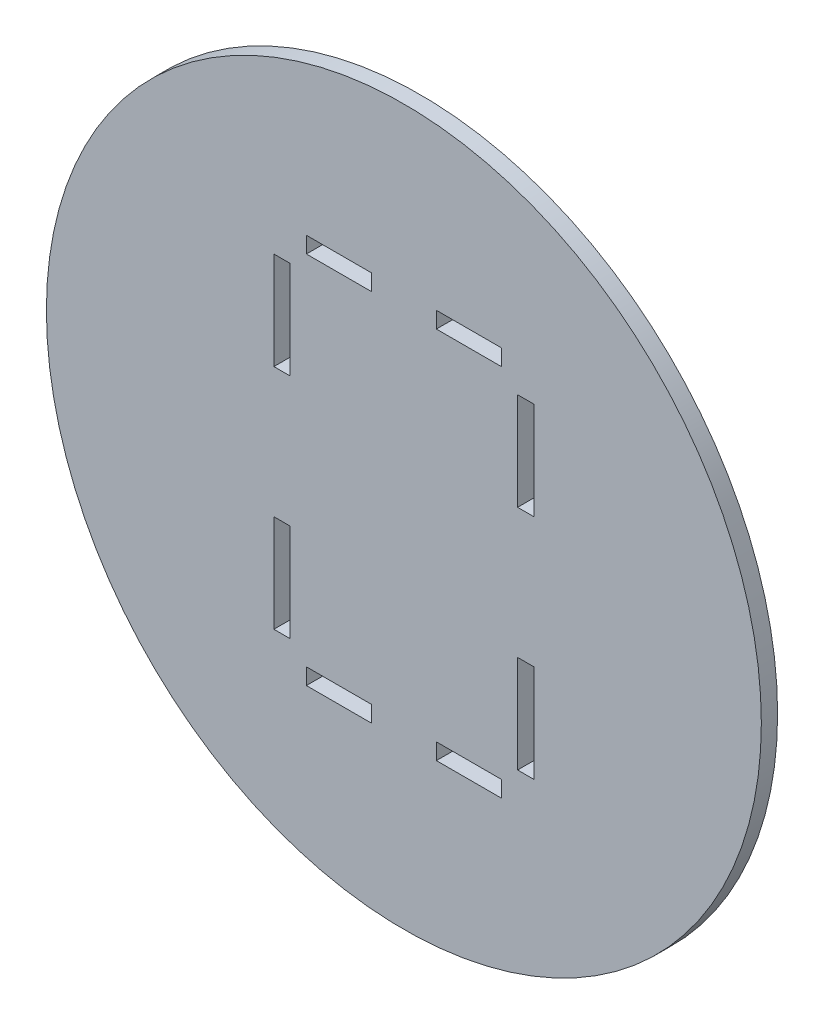
ISO-10303-21;
HEADER;
FILE_DESCRIPTION(('STEP AP214'),'2;1');
FILE_NAME('part.step','',(''),(''),'','','');
FILE_SCHEMA(('AUTOMOTIVE_DESIGN { 1 0 10303 214 1 1 1 1 }'));
ENDSEC;
DATA;
#1=APPLICATION_CONTEXT('core data for automotive mechanical design processes');
#2=APPLICATION_PROTOCOL_DEFINITION('international standard','automotive_design',2000,#1);
#3=PRODUCT_CONTEXT('',#1,'mechanical');
#4=PRODUCT('Part','Part','',(#3));
#5=PRODUCT_RELATED_PRODUCT_CATEGORY('part','',(#4));
#6=PRODUCT_DEFINITION_FORMATION('','',#4);
#7=PRODUCT_DEFINITION_CONTEXT('part definition',#1,'design');
#8=PRODUCT_DEFINITION('design','',#6,#7);
#9=PRODUCT_DEFINITION_SHAPE('','',#8);
#10=(LENGTH_UNIT() NAMED_UNIT(*) SI_UNIT(.MILLI.,.METRE.));
#11=(NAMED_UNIT(*) PLANE_ANGLE_UNIT() SI_UNIT($,.RADIAN.));
#12=(NAMED_UNIT(*) SI_UNIT($,.STERADIAN.) SOLID_ANGLE_UNIT());
#13=UNCERTAINTY_MEASURE_WITH_UNIT(LENGTH_MEASURE(1.E-05),#10,'distance_accuracy_value','');
#14=(GEOMETRIC_REPRESENTATION_CONTEXT(3) GLOBAL_UNCERTAINTY_ASSIGNED_CONTEXT((#13)) GLOBAL_UNIT_ASSIGNED_CONTEXT((#10,
#11,#12)) REPRESENTATION_CONTEXT('',''));
#15=CARTESIAN_POINT('',(0.,0.,0.));
#16=DIRECTION('',(0.,0.,1.));
#17=DIRECTION('',(1.,0.,0.));
#18=AXIS2_PLACEMENT_3D('',#15,#16,#17);
#19=CARTESIAN_POINT('',(0.,0.,5.));
#20=DIRECTION('',(0.,0.,1.));
#21=DIRECTION('',(1.,0.,0.));
#22=AXIS2_PLACEMENT_3D('',#19,#20,#21);
#23=PLANE('',#22);
#24=CARTESIAN_POINT('',(0.,0.,5.));
#25=DIRECTION('',(0.,0.,1.));
#26=DIRECTION('',(1.,0.,0.));
#27=AXIS2_PLACEMENT_3D('',#24,#25,#26);
#28=CIRCLE('',#27,110.);
#29=CARTESIAN_POINT('',(110.,0.,5.));
#30=VERTEX_POINT('',#29);
#31=EDGE_CURVE('E11',#30,#30,#28,.T.);
#32=ORIENTED_EDGE('',*,*,#31,.T.);
#33=EDGE_LOOP('',(#32));
#34=FACE_BOUND('',#33,.T.);
#35=DIRECTION('',(1.,0.,0.));
#36=VECTOR('',#35,1.);
#37=CARTESIAN_POINT('',(-30.,55.,5.));
#38=LINE('',#37,#36);
#39=CARTESIAN_POINT('',(-30.,55.,5.));
#40=VERTEX_POINT('',#39);
#41=CARTESIAN_POINT('',(-10.,55.,5.));
#42=VERTEX_POINT('',#41);
#43=EDGE_CURVE('E466',#40,#42,#38,.T.);
#44=ORIENTED_EDGE('',*,*,#43,.F.);
#45=DIRECTION('',(0.,-1.,0.));
#46=VECTOR('',#45,1.);
#47=CARTESIAN_POINT('',(-30.,60.,5.));
#48=LINE('',#47,#46);
#49=CARTESIAN_POINT('',(-30.,60.,5.));
#50=VERTEX_POINT('',#49);
#51=EDGE_CURVE('E464',#50,#40,#48,.T.);
#52=ORIENTED_EDGE('',*,*,#51,.F.);
#53=DIRECTION('',(-1.,0.,0.));
#54=VECTOR('',#53,1.);
#55=CARTESIAN_POINT('',(-30.,60.,5.));
#56=LINE('',#55,#54);
#57=CARTESIAN_POINT('',(-10.,60.,5.));
#58=VERTEX_POINT('',#57);
#59=EDGE_CURVE('E472',#58,#50,#56,.T.);
#60=ORIENTED_EDGE('',*,*,#59,.F.);
#61=DIRECTION('',(0.,1.,0.));
#62=VECTOR('',#61,1.);
#63=CARTESIAN_POINT('',(-10.,60.,5.));
#64=LINE('',#63,#62);
#65=EDGE_CURVE('E469',#42,#58,#64,.T.);
#66=ORIENTED_EDGE('',*,*,#65,.F.);
#67=EDGE_LOOP('',(#44,#52,#60,#66));
#68=FACE_BOUND('',#67,.T.);
#69=DIRECTION('',(1.,0.,0.));
#70=VECTOR('',#69,1.);
#71=CARTESIAN_POINT('',(10.,55.,5.));
#72=LINE('',#71,#70);
#73=CARTESIAN_POINT('',(10.,55.,5.));
#74=VERTEX_POINT('',#73);
#75=CARTESIAN_POINT('',(30.,55.,5.));
#76=VERTEX_POINT('',#75);
#77=EDGE_CURVE('E435',#74,#76,#72,.T.);
#78=ORIENTED_EDGE('',*,*,#77,.F.);
#79=DIRECTION('',(0.,-1.,0.));
#80=VECTOR('',#79,1.);
#81=CARTESIAN_POINT('',(10.,60.,5.));
#82=LINE('',#81,#80);
#83=CARTESIAN_POINT('',(10.,60.,5.));
#84=VERTEX_POINT('',#83);
#85=EDGE_CURVE('E433',#84,#74,#82,.T.);
#86=ORIENTED_EDGE('',*,*,#85,.F.);
#87=DIRECTION('',(-1.,0.,0.));
#88=VECTOR('',#87,1.);
#89=CARTESIAN_POINT('',(10.,60.,5.));
#90=LINE('',#89,#88);
#91=CARTESIAN_POINT('',(30.,60.,5.));
#92=VERTEX_POINT('',#91);
#93=EDGE_CURVE('E441',#92,#84,#90,.T.);
#94=ORIENTED_EDGE('',*,*,#93,.F.);
#95=DIRECTION('',(0.,1.,0.));
#96=VECTOR('',#95,1.);
#97=CARTESIAN_POINT('',(30.,60.,5.));
#98=LINE('',#97,#96);
#99=EDGE_CURVE('E438',#76,#92,#98,.T.);
#100=ORIENTED_EDGE('',*,*,#99,.F.);
#101=EDGE_LOOP('',(#78,#86,#94,#100));
#102=FACE_BOUND('',#101,.T.);
#103=DIRECTION('',(-1.,0.,0.));
#104=VECTOR('',#103,1.);
#105=CARTESIAN_POINT('',(40.,50.,5.));
#106=LINE('',#105,#104);
#107=CARTESIAN_POINT('',(40.,50.,5.));
#108=VERTEX_POINT('',#107);
#109=CARTESIAN_POINT('',(35.,50.,5.));
#110=VERTEX_POINT('',#109);
#111=EDGE_CURVE('E404',#108,#110,#106,.T.);
#112=ORIENTED_EDGE('',*,*,#111,.F.);
#113=DIRECTION('',(0.,1.,0.));
#114=VECTOR('',#113,1.);
#115=CARTESIAN_POINT('',(40.,50.,5.));
#116=LINE('',#115,#114);
#117=CARTESIAN_POINT('',(40.,20.,5.));
#118=VERTEX_POINT('',#117);
#119=EDGE_CURVE('E402',#118,#108,#116,.T.);
#120=ORIENTED_EDGE('',*,*,#119,.F.);
#121=DIRECTION('',(1.,0.,0.));
#122=VECTOR('',#121,1.);
#123=CARTESIAN_POINT('',(40.,20.,5.));
#124=LINE('',#123,#122);
#125=CARTESIAN_POINT('',(35.,20.,5.));
#126=VERTEX_POINT('',#125);
#127=EDGE_CURVE('E410',#126,#118,#124,.T.);
#128=ORIENTED_EDGE('',*,*,#127,.F.);
#129=DIRECTION('',(0.,-1.,0.));
#130=VECTOR('',#129,1.);
#131=CARTESIAN_POINT('',(35.,50.,5.));
#132=LINE('',#131,#130);
#133=EDGE_CURVE('E407',#110,#126,#132,.T.);
#134=ORIENTED_EDGE('',*,*,#133,.F.);
#135=EDGE_LOOP('',(#112,#120,#128,#134));
#136=FACE_BOUND('',#135,.T.);
#137=DIRECTION('',(-1.,0.,0.));
#138=VECTOR('',#137,1.);
#139=CARTESIAN_POINT('',(40.,-20.,5.));
#140=LINE('',#139,#138);
#141=CARTESIAN_POINT('',(40.,-20.,5.));
#142=VERTEX_POINT('',#141);
#143=CARTESIAN_POINT('',(35.,-20.,5.));
#144=VERTEX_POINT('',#143);
#145=EDGE_CURVE('E373',#142,#144,#140,.T.);
#146=ORIENTED_EDGE('',*,*,#145,.F.);
#147=DIRECTION('',(0.,1.,0.));
#148=VECTOR('',#147,1.);
#149=CARTESIAN_POINT('',(40.,-20.,5.));
#150=LINE('',#149,#148);
#151=CARTESIAN_POINT('',(40.0000000000001,-50.,5.));
#152=VERTEX_POINT('',#151);
#153=EDGE_CURVE('E371',#152,#142,#150,.T.);
#154=ORIENTED_EDGE('',*,*,#153,.F.);
#155=DIRECTION('',(1.,0.,0.));
#156=VECTOR('',#155,1.);
#157=CARTESIAN_POINT('',(40.0000000000001,-50.,5.));
#158=LINE('',#157,#156);
#159=CARTESIAN_POINT('',(35.,-50.,5.));
#160=VERTEX_POINT('',#159);
#161=EDGE_CURVE('E379',#160,#152,#158,.T.);
#162=ORIENTED_EDGE('',*,*,#161,.F.);
#163=DIRECTION('',(0.,-1.,0.));
#164=VECTOR('',#163,1.);
#165=CARTESIAN_POINT('',(35.,-20.,5.));
#166=LINE('',#165,#164);
#167=EDGE_CURVE('E376',#144,#160,#166,.T.);
#168=ORIENTED_EDGE('',*,*,#167,.F.);
#169=EDGE_LOOP('',(#146,#154,#162,#168));
#170=FACE_BOUND('',#169,.T.);
#171=DIRECTION('',(-1.,0.,0.));
#172=VECTOR('',#171,1.);
#173=CARTESIAN_POINT('',(30.0000000000001,-55.,5.));
#174=LINE('',#173,#172);
#175=CARTESIAN_POINT('',(30.0000000000001,-55.,5.));
#176=VERTEX_POINT('',#175);
#177=CARTESIAN_POINT('',(10.0000000000001,-55.,5.));
#178=VERTEX_POINT('',#177);
#179=EDGE_CURVE('E342',#176,#178,#174,.T.);
#180=ORIENTED_EDGE('',*,*,#179,.F.);
#181=DIRECTION('',(0.,1.,0.));
#182=VECTOR('',#181,1.);
#183=CARTESIAN_POINT('',(30.0000000000001,-60.,5.));
#184=LINE('',#183,#182);
#185=CARTESIAN_POINT('',(30.0000000000001,-60.,5.));
#186=VERTEX_POINT('',#185);
#187=EDGE_CURVE('E340',#186,#176,#184,.T.);
#188=ORIENTED_EDGE('',*,*,#187,.F.);
#189=DIRECTION('',(1.,0.,0.));
#190=VECTOR('',#189,1.);
#191=CARTESIAN_POINT('',(30.0000000000001,-60.,5.));
#192=LINE('',#191,#190);
#193=CARTESIAN_POINT('',(10.0000000000001,-60.,5.));
#194=VERTEX_POINT('',#193);
#195=EDGE_CURVE('E348',#194,#186,#192,.T.);
#196=ORIENTED_EDGE('',*,*,#195,.F.);
#197=DIRECTION('',(0.,-1.,0.));
#198=VECTOR('',#197,1.);
#199=CARTESIAN_POINT('',(10.0000000000001,-60.,5.));
#200=LINE('',#199,#198);
#201=EDGE_CURVE('E345',#178,#194,#200,.T.);
#202=ORIENTED_EDGE('',*,*,#201,.F.);
#203=EDGE_LOOP('',(#180,#188,#196,#202));
#204=FACE_BOUND('',#203,.T.);
#205=DIRECTION('',(-1.,0.,0.));
#206=VECTOR('',#205,1.);
#207=CARTESIAN_POINT('',(-9.99999999999993,-55.,5.));
#208=LINE('',#207,#206);
#209=CARTESIAN_POINT('',(-9.99999999999993,-55.,5.));
#210=VERTEX_POINT('',#209);
#211=CARTESIAN_POINT('',(-29.9999999999999,-55.,5.));
#212=VERTEX_POINT('',#211);
#213=EDGE_CURVE('E311',#210,#212,#208,.T.);
#214=ORIENTED_EDGE('',*,*,#213,.F.);
#215=DIRECTION('',(0.,1.,0.));
#216=VECTOR('',#215,1.);
#217=CARTESIAN_POINT('',(-9.99999999999993,-60.,5.));
#218=LINE('',#217,#216);
#219=CARTESIAN_POINT('',(-9.99999999999993,-60.,5.));
#220=VERTEX_POINT('',#219);
#221=EDGE_CURVE('E309',#220,#210,#218,.T.);
#222=ORIENTED_EDGE('',*,*,#221,.F.);
#223=DIRECTION('',(1.,0.,0.));
#224=VECTOR('',#223,1.);
#225=CARTESIAN_POINT('',(-9.99999999999993,-60.,5.));
#226=LINE('',#225,#224);
#227=CARTESIAN_POINT('',(-29.9999999999999,-60.,5.));
#228=VERTEX_POINT('',#227);
#229=EDGE_CURVE('E317',#228,#220,#226,.T.);
#230=ORIENTED_EDGE('',*,*,#229,.F.);
#231=DIRECTION('',(0.,-1.,0.));
#232=VECTOR('',#231,1.);
#233=CARTESIAN_POINT('',(-29.9999999999999,-60.,5.));
#234=LINE('',#233,#232);
#235=EDGE_CURVE('E314',#212,#228,#234,.T.);
#236=ORIENTED_EDGE('',*,*,#235,.F.);
#237=EDGE_LOOP('',(#214,#222,#230,#236));
#238=FACE_BOUND('',#237,.T.);
#239=DIRECTION('',(1.,0.,0.));
#240=VECTOR('',#239,1.);
#241=CARTESIAN_POINT('',(-40.,-50.,5.));
#242=LINE('',#241,#240);
#243=CARTESIAN_POINT('',(-40.,-50.,5.));
#244=VERTEX_POINT('',#243);
#245=CARTESIAN_POINT('',(-35.,-50.,5.));
#246=VERTEX_POINT('',#245);
#247=EDGE_CURVE('E280',#244,#246,#242,.T.);
#248=ORIENTED_EDGE('',*,*,#247,.F.);
#249=DIRECTION('',(0.,-1.,0.));
#250=VECTOR('',#249,1.);
#251=CARTESIAN_POINT('',(-40.,-50.,5.));
#252=LINE('',#251,#250);
#253=CARTESIAN_POINT('',(-40.,-20.,5.));
#254=VERTEX_POINT('',#253);
#255=EDGE_CURVE('E278',#254,#244,#252,.T.);
#256=ORIENTED_EDGE('',*,*,#255,.F.);
#257=DIRECTION('',(-1.,0.,0.));
#258=VECTOR('',#257,1.);
#259=CARTESIAN_POINT('',(-40.,-20.,5.));
#260=LINE('',#259,#258);
#261=CARTESIAN_POINT('',(-35.,-20.,5.));
#262=VERTEX_POINT('',#261);
#263=EDGE_CURVE('E286',#262,#254,#260,.T.);
#264=ORIENTED_EDGE('',*,*,#263,.F.);
#265=DIRECTION('',(0.,1.,0.));
#266=VECTOR('',#265,1.);
#267=CARTESIAN_POINT('',(-35.,-50.,5.));
#268=LINE('',#267,#266);
#269=EDGE_CURVE('E283',#246,#262,#268,.T.);
#270=ORIENTED_EDGE('',*,*,#269,.F.);
#271=EDGE_LOOP('',(#248,#256,#264,#270));
#272=FACE_BOUND('',#271,.T.);
#273=DIRECTION('',(1.,0.,0.));
#274=VECTOR('',#273,1.);
#275=CARTESIAN_POINT('',(-40.,20.,5.));
#276=LINE('',#275,#274);
#277=CARTESIAN_POINT('',(-40.,20.,5.));
#278=VERTEX_POINT('',#277);
#279=CARTESIAN_POINT('',(-35.,20.,5.));
#280=VERTEX_POINT('',#279);
#281=EDGE_CURVE('E250',#278,#280,#276,.T.);
#282=ORIENTED_EDGE('',*,*,#281,.F.);
#283=DIRECTION('',(0.,-1.,0.));
#284=VECTOR('',#283,1.);
#285=CARTESIAN_POINT('',(-40.,20.,5.));
#286=LINE('',#285,#284);
#287=CARTESIAN_POINT('',(-40.,50.,5.));
#288=VERTEX_POINT('',#287);
#289=EDGE_CURVE('E242',#288,#278,#286,.T.);
#290=ORIENTED_EDGE('',*,*,#289,.F.);
#291=DIRECTION('',(-1.,0.,0.));
#292=VECTOR('',#291,1.);
#293=CARTESIAN_POINT('',(-40.,50.,5.));
#294=LINE('',#293,#292);
#295=CARTESIAN_POINT('',(-35.,50.,5.));
#296=VERTEX_POINT('',#295);
#297=EDGE_CURVE('E264',#296,#288,#294,.T.);
#298=ORIENTED_EDGE('',*,*,#297,.F.);
#299=DIRECTION('',(0.,1.,0.));
#300=VECTOR('',#299,1.);
#301=CARTESIAN_POINT('',(-35.,20.,5.));
#302=LINE('',#301,#300);
#303=EDGE_CURVE('E262',#280,#296,#302,.T.);
#304=ORIENTED_EDGE('',*,*,#303,.F.);
#305=EDGE_LOOP('',(#282,#290,#298,#304));
#306=FACE_BOUND('',#305,.T.);
#307=ADVANCED_FACE('F33',(#34,#68,#102,#136,#170,#204,#238,#272,#306),#23,.T.);
#308=CARTESIAN_POINT('',(0.,0.,0.));
#309=DIRECTION('',(0.,0.,1.));
#310=DIRECTION('',(1.,0.,0.));
#311=AXIS2_PLACEMENT_3D('',#308,#309,#310);
#312=PLANE('',#311);
#313=DIRECTION('',(0.,-1.,0.));
#314=VECTOR('',#313,1.);
#315=CARTESIAN_POINT('',(-40.,-50.,0.));
#316=LINE('',#315,#314);
#317=CARTESIAN_POINT('',(-40.,-20.,0.));
#318=VERTEX_POINT('',#317);
#319=CARTESIAN_POINT('',(-40.,-50.,0.));
#320=VERTEX_POINT('',#319);
#321=EDGE_CURVE('E258',#318,#320,#316,.T.);
#322=ORIENTED_EDGE('',*,*,#321,.T.);
#323=DIRECTION('',(1.,0.,0.));
#324=VECTOR('',#323,1.);
#325=CARTESIAN_POINT('',(-40.,-50.,0.));
#326=LINE('',#325,#324);
#327=CARTESIAN_POINT('',(-35.,-50.,0.));
#328=VERTEX_POINT('',#327);
#329=EDGE_CURVE('E291',#320,#328,#326,.T.);
#330=ORIENTED_EDGE('',*,*,#329,.T.);
#331=DIRECTION('',(0.,1.,0.));
#332=VECTOR('',#331,1.);
#333=CARTESIAN_POINT('',(-35.,-50.,0.));
#334=LINE('',#333,#332);
#335=CARTESIAN_POINT('',(-35.,-20.,0.));
#336=VERTEX_POINT('',#335);
#337=EDGE_CURVE('E294',#328,#336,#334,.T.);
#338=ORIENTED_EDGE('',*,*,#337,.T.);
#339=DIRECTION('',(-1.,0.,0.));
#340=VECTOR('',#339,1.);
#341=CARTESIAN_POINT('',(-40.,-20.,0.));
#342=LINE('',#341,#340);
#343=EDGE_CURVE('E281',#336,#318,#342,.T.);
#344=ORIENTED_EDGE('',*,*,#343,.T.);
#345=EDGE_LOOP('',(#322,#330,#338,#344));
#346=FACE_BOUND('',#345,.T.);
#347=DIRECTION('',(0.,1.,0.));
#348=VECTOR('',#347,1.);
#349=CARTESIAN_POINT('',(30.0000000000001,-60.,0.));
#350=LINE('',#349,#348);
#351=CARTESIAN_POINT('',(30.0000000000001,-60.,0.));
#352=VERTEX_POINT('',#351);
#353=CARTESIAN_POINT('',(30.0000000000001,-55.,0.));
#354=VERTEX_POINT('',#353);
#355=EDGE_CURVE('E339',#352,#354,#350,.T.);
#356=ORIENTED_EDGE('',*,*,#355,.T.);
#357=DIRECTION('',(-1.,0.,0.));
#358=VECTOR('',#357,1.);
#359=CARTESIAN_POINT('',(30.0000000000001,-55.,0.));
#360=LINE('',#359,#358);
#361=CARTESIAN_POINT('',(10.0000000000001,-55.,0.));
#362=VERTEX_POINT('',#361);
#363=EDGE_CURVE('E353',#354,#362,#360,.T.);
#364=ORIENTED_EDGE('',*,*,#363,.T.);
#365=DIRECTION('',(0.,-1.,0.));
#366=VECTOR('',#365,1.);
#367=CARTESIAN_POINT('',(10.0000000000001,-60.,0.));
#368=LINE('',#367,#366);
#369=CARTESIAN_POINT('',(10.0000000000001,-60.,0.));
#370=VERTEX_POINT('',#369);
#371=EDGE_CURVE('E356',#362,#370,#368,.T.);
#372=ORIENTED_EDGE('',*,*,#371,.T.);
#373=DIRECTION('',(1.,0.,0.));
#374=VECTOR('',#373,1.);
#375=CARTESIAN_POINT('',(30.0000000000001,-60.,0.));
#376=LINE('',#375,#374);
#377=EDGE_CURVE('E343',#370,#352,#376,.T.);
#378=ORIENTED_EDGE('',*,*,#377,.T.);
#379=EDGE_LOOP('',(#356,#364,#372,#378));
#380=FACE_BOUND('',#379,.T.);
#381=DIRECTION('',(0.,1.,0.));
#382=VECTOR('',#381,1.);
#383=CARTESIAN_POINT('',(40.,50.,0.));
#384=LINE('',#383,#382);
#385=CARTESIAN_POINT('',(40.,20.,0.));
#386=VERTEX_POINT('',#385);
#387=CARTESIAN_POINT('',(40.,50.,0.));
#388=VERTEX_POINT('',#387);
#389=EDGE_CURVE('E401',#386,#388,#384,.T.);
#390=ORIENTED_EDGE('',*,*,#389,.T.);
#391=DIRECTION('',(-1.,0.,0.));
#392=VECTOR('',#391,1.);
#393=CARTESIAN_POINT('',(40.,50.,0.));
#394=LINE('',#393,#392);
#395=CARTESIAN_POINT('',(35.,50.,0.));
#396=VERTEX_POINT('',#395);
#397=EDGE_CURVE('E415',#388,#396,#394,.T.);
#398=ORIENTED_EDGE('',*,*,#397,.T.);
#399=DIRECTION('',(0.,-1.,0.));
#400=VECTOR('',#399,1.);
#401=CARTESIAN_POINT('',(35.,50.,0.));
#402=LINE('',#401,#400);
#403=CARTESIAN_POINT('',(35.,20.,0.));
#404=VERTEX_POINT('',#403);
#405=EDGE_CURVE('E418',#396,#404,#402,.T.);
#406=ORIENTED_EDGE('',*,*,#405,.T.);
#407=DIRECTION('',(1.,0.,0.));
#408=VECTOR('',#407,1.);
#409=CARTESIAN_POINT('',(40.,20.,0.));
#410=LINE('',#409,#408);
#411=EDGE_CURVE('E405',#404,#386,#410,.T.);
#412=ORIENTED_EDGE('',*,*,#411,.T.);
#413=EDGE_LOOP('',(#390,#398,#406,#412));
#414=FACE_BOUND('',#413,.T.);
#415=DIRECTION('',(0.,-1.,0.));
#416=VECTOR('',#415,1.);
#417=CARTESIAN_POINT('',(-30.,60.,0.));
#418=LINE('',#417,#416);
#419=CARTESIAN_POINT('',(-30.,60.,0.));
#420=VERTEX_POINT('',#419);
#421=CARTESIAN_POINT('',(-30.,55.,0.));
#422=VERTEX_POINT('',#421);
#423=EDGE_CURVE('E463',#420,#422,#418,.T.);
#424=ORIENTED_EDGE('',*,*,#423,.T.);
#425=DIRECTION('',(1.,0.,0.));
#426=VECTOR('',#425,1.);
#427=CARTESIAN_POINT('',(-30.,55.,0.));
#428=LINE('',#427,#426);
#429=CARTESIAN_POINT('',(-10.,55.,0.));
#430=VERTEX_POINT('',#429);
#431=EDGE_CURVE('E477',#422,#430,#428,.T.);
#432=ORIENTED_EDGE('',*,*,#431,.T.);
#433=DIRECTION('',(0.,1.,0.));
#434=VECTOR('',#433,1.);
#435=CARTESIAN_POINT('',(-10.,60.,0.));
#436=LINE('',#435,#434);
#437=CARTESIAN_POINT('',(-10.,60.,0.));
#438=VERTEX_POINT('',#437);
#439=EDGE_CURVE('E480',#430,#438,#436,.T.);
#440=ORIENTED_EDGE('',*,*,#439,.T.);
#441=DIRECTION('',(-1.,0.,0.));
#442=VECTOR('',#441,1.);
#443=CARTESIAN_POINT('',(-30.,60.,0.));
#444=LINE('',#443,#442);
#445=EDGE_CURVE('E467',#438,#420,#444,.T.);
#446=ORIENTED_EDGE('',*,*,#445,.T.);
#447=EDGE_LOOP('',(#424,#432,#440,#446));
#448=FACE_BOUND('',#447,.T.);
#449=CARTESIAN_POINT('',(0.,0.,0.));
#450=DIRECTION('',(0.,0.,1.));
#451=DIRECTION('',(1.,0.,0.));
#452=AXIS2_PLACEMENT_3D('',#449,#450,#451);
#453=CIRCLE('',#452,110.);
#454=CARTESIAN_POINT('',(110.,0.,0.));
#455=VERTEX_POINT('',#454);
#456=EDGE_CURVE('E37',#455,#455,#453,.T.);
#457=ORIENTED_EDGE('',*,*,#456,.F.);
#458=EDGE_LOOP('',(#457));
#459=FACE_BOUND('',#458,.T.);
#460=DIRECTION('',(0.,-1.,0.));
#461=VECTOR('',#460,1.);
#462=CARTESIAN_POINT('',(10.,60.,0.));
#463=LINE('',#462,#461);
#464=CARTESIAN_POINT('',(10.,60.,0.));
#465=VERTEX_POINT('',#464);
#466=CARTESIAN_POINT('',(10.,55.,0.));
#467=VERTEX_POINT('',#466);
#468=EDGE_CURVE('E432',#465,#467,#463,.T.);
#469=ORIENTED_EDGE('',*,*,#468,.T.);
#470=DIRECTION('',(1.,0.,0.));
#471=VECTOR('',#470,1.);
#472=CARTESIAN_POINT('',(10.,55.,0.));
#473=LINE('',#472,#471);
#474=CARTESIAN_POINT('',(30.,55.,0.));
#475=VERTEX_POINT('',#474);
#476=EDGE_CURVE('E446',#467,#475,#473,.T.);
#477=ORIENTED_EDGE('',*,*,#476,.T.);
#478=DIRECTION('',(0.,1.,0.));
#479=VECTOR('',#478,1.);
#480=CARTESIAN_POINT('',(30.,60.,0.));
#481=LINE('',#480,#479);
#482=CARTESIAN_POINT('',(30.,60.,0.));
#483=VERTEX_POINT('',#482);
#484=EDGE_CURVE('E449',#475,#483,#481,.T.);
#485=ORIENTED_EDGE('',*,*,#484,.T.);
#486=DIRECTION('',(-1.,0.,0.));
#487=VECTOR('',#486,1.);
#488=CARTESIAN_POINT('',(10.,60.,0.));
#489=LINE('',#488,#487);
#490=EDGE_CURVE('E436',#483,#465,#489,.T.);
#491=ORIENTED_EDGE('',*,*,#490,.T.);
#492=EDGE_LOOP('',(#469,#477,#485,#491));
#493=FACE_BOUND('',#492,.T.);
#494=DIRECTION('',(0.,1.,0.));
#495=VECTOR('',#494,1.);
#496=CARTESIAN_POINT('',(40.,-20.,0.));
#497=LINE('',#496,#495);
#498=CARTESIAN_POINT('',(40.0000000000001,-50.,0.));
#499=VERTEX_POINT('',#498);
#500=CARTESIAN_POINT('',(40.,-20.,0.));
#501=VERTEX_POINT('',#500);
#502=EDGE_CURVE('E370',#499,#501,#497,.T.);
#503=ORIENTED_EDGE('',*,*,#502,.T.);
#504=DIRECTION('',(-1.,0.,0.));
#505=VECTOR('',#504,1.);
#506=CARTESIAN_POINT('',(40.,-20.,0.));
#507=LINE('',#506,#505);
#508=CARTESIAN_POINT('',(35.,-20.,0.));
#509=VERTEX_POINT('',#508);
#510=EDGE_CURVE('E384',#501,#509,#507,.T.);
#511=ORIENTED_EDGE('',*,*,#510,.T.);
#512=DIRECTION('',(0.,-1.,0.));
#513=VECTOR('',#512,1.);
#514=CARTESIAN_POINT('',(35.,-20.,0.));
#515=LINE('',#514,#513);
#516=CARTESIAN_POINT('',(35.,-50.,0.));
#517=VERTEX_POINT('',#516);
#518=EDGE_CURVE('E387',#509,#517,#515,.T.);
#519=ORIENTED_EDGE('',*,*,#518,.T.);
#520=DIRECTION('',(1.,0.,0.));
#521=VECTOR('',#520,1.);
#522=CARTESIAN_POINT('',(40.0000000000001,-50.,0.));
#523=LINE('',#522,#521);
#524=EDGE_CURVE('E374',#517,#499,#523,.T.);
#525=ORIENTED_EDGE('',*,*,#524,.T.);
#526=EDGE_LOOP('',(#503,#511,#519,#525));
#527=FACE_BOUND('',#526,.T.);
#528=DIRECTION('',(0.,1.,0.));
#529=VECTOR('',#528,1.);
#530=CARTESIAN_POINT('',(-9.99999999999993,-60.,0.));
#531=LINE('',#530,#529);
#532=CARTESIAN_POINT('',(-9.99999999999993,-60.,0.));
#533=VERTEX_POINT('',#532);
#534=CARTESIAN_POINT('',(-9.99999999999993,-55.,0.));
#535=VERTEX_POINT('',#534);
#536=EDGE_CURVE('E308',#533,#535,#531,.T.);
#537=ORIENTED_EDGE('',*,*,#536,.T.);
#538=DIRECTION('',(-1.,0.,0.));
#539=VECTOR('',#538,1.);
#540=CARTESIAN_POINT('',(-9.99999999999993,-55.,0.));
#541=LINE('',#540,#539);
#542=CARTESIAN_POINT('',(-29.9999999999999,-55.,0.));
#543=VERTEX_POINT('',#542);
#544=EDGE_CURVE('E322',#535,#543,#541,.T.);
#545=ORIENTED_EDGE('',*,*,#544,.T.);
#546=DIRECTION('',(0.,-1.,0.));
#547=VECTOR('',#546,1.);
#548=CARTESIAN_POINT('',(-29.9999999999999,-60.,0.));
#549=LINE('',#548,#547);
#550=CARTESIAN_POINT('',(-29.9999999999999,-60.,0.));
#551=VERTEX_POINT('',#550);
#552=EDGE_CURVE('E325',#543,#551,#549,.T.);
#553=ORIENTED_EDGE('',*,*,#552,.T.);
#554=DIRECTION('',(1.,0.,0.));
#555=VECTOR('',#554,1.);
#556=CARTESIAN_POINT('',(-9.99999999999993,-60.,0.));
#557=LINE('',#556,#555);
#558=EDGE_CURVE('E312',#551,#533,#557,.T.);
#559=ORIENTED_EDGE('',*,*,#558,.T.);
#560=EDGE_LOOP('',(#537,#545,#553,#559));
#561=FACE_BOUND('',#560,.T.);
#562=DIRECTION('',(0.,-1.,0.));
#563=VECTOR('',#562,1.);
#564=CARTESIAN_POINT('',(-40.,20.,0.));
#565=LINE('',#564,#563);
#566=CARTESIAN_POINT('',(-40.,50.,0.));
#567=VERTEX_POINT('',#566);
#568=CARTESIAN_POINT('',(-40.,20.,0.));
#569=VERTEX_POINT('',#568);
#570=EDGE_CURVE('E56',#567,#569,#565,.T.);
#571=ORIENTED_EDGE('',*,*,#570,.T.);
#572=DIRECTION('',(1.,0.,0.));
#573=VECTOR('',#572,1.);
#574=CARTESIAN_POINT('',(-40.,20.,0.));
#575=LINE('',#574,#573);
#576=CARTESIAN_POINT('',(-35.,20.,0.));
#577=VERTEX_POINT('',#576);
#578=EDGE_CURVE('E257',#569,#577,#575,.T.);
#579=ORIENTED_EDGE('',*,*,#578,.T.);
#580=DIRECTION('',(0.,1.,0.));
#581=VECTOR('',#580,1.);
#582=CARTESIAN_POINT('',(-35.,20.,0.));
#583=LINE('',#582,#581);
#584=CARTESIAN_POINT('',(-35.,50.,0.));
#585=VERTEX_POINT('',#584);
#586=EDGE_CURVE('E270',#577,#585,#583,.T.);
#587=ORIENTED_EDGE('',*,*,#586,.T.);
#588=DIRECTION('',(-1.,0.,0.));
#589=VECTOR('',#588,1.);
#590=CARTESIAN_POINT('',(-40.,50.,0.));
#591=LINE('',#590,#589);
#592=EDGE_CURVE('E251',#585,#567,#591,.T.);
#593=ORIENTED_EDGE('',*,*,#592,.T.);
#594=EDGE_LOOP('',(#571,#579,#587,#593));
#595=FACE_BOUND('',#594,.T.);
#596=ADVANCED_FACE('F499',(#346,#380,#414,#448,#459,#493,#527,#561,#595),#312,.F.);
#597=CARTESIAN_POINT('',(0.,0.,5.));
#598=DIRECTION('',(0.,0.,-1.));
#599=DIRECTION('',(-1.,0.,0.));
#600=AXIS2_PLACEMENT_3D('',#597,#598,#599);
#601=CYLINDRICAL_SURFACE('',#600,110.);
#602=ORIENTED_EDGE('',*,*,#31,.F.);
#603=EDGE_LOOP('',(#602));
#604=FACE_BOUND('',#603,.T.);
#605=ORIENTED_EDGE('',*,*,#456,.T.);
#606=EDGE_LOOP('',(#605));
#607=FACE_BOUND('',#606,.T.);
#608=ADVANCED_FACE('F35',(#604,#607),#601,.T.);
#609=CARTESIAN_POINT('',(-30.,60.,5.));
#610=DIRECTION('',(1.,0.,0.));
#611=DIRECTION('',(0.,0.,-1.));
#612=AXIS2_PLACEMENT_3D('',#609,#610,#611);
#613=PLANE('',#612);
#614=ORIENTED_EDGE('',*,*,#423,.F.);
#615=DIRECTION('',(0.,0.,-1.));
#616=VECTOR('',#615,1.);
#617=CARTESIAN_POINT('',(-30.,60.,5.));
#618=LINE('',#617,#616);
#619=EDGE_CURVE('E474',#50,#420,#618,.T.);
#620=ORIENTED_EDGE('',*,*,#619,.F.);
#621=ORIENTED_EDGE('',*,*,#51,.T.);
#622=DIRECTION('',(0.,0.,-1.));
#623=VECTOR('',#622,1.);
#624=CARTESIAN_POINT('',(-30.,55.,5.));
#625=LINE('',#624,#623);
#626=EDGE_CURVE('E491',#40,#422,#625,.T.);
#627=ORIENTED_EDGE('',*,*,#626,.T.);
#628=EDGE_LOOP('',(#614,#620,#621,#627));
#629=FACE_BOUND('',#628,.T.);
#630=ADVANCED_FACE('F523',(#629),#613,.T.);
#631=CARTESIAN_POINT('',(-30.,55.,5.));
#632=DIRECTION('',(0.,1.,0.));
#633=DIRECTION('',(0.,0.,1.));
#634=AXIS2_PLACEMENT_3D('',#631,#632,#633);
#635=PLANE('',#634);
#636=ORIENTED_EDGE('',*,*,#431,.F.);
#637=ORIENTED_EDGE('',*,*,#626,.F.);
#638=ORIENTED_EDGE('',*,*,#43,.T.);
#639=DIRECTION('',(0.,0.,-1.));
#640=VECTOR('',#639,1.);
#641=CARTESIAN_POINT('',(-10.,55.,5.));
#642=LINE('',#641,#640);
#643=EDGE_CURVE('E489',#42,#430,#642,.T.);
#644=ORIENTED_EDGE('',*,*,#643,.T.);
#645=EDGE_LOOP('',(#636,#637,#638,#644));
#646=FACE_BOUND('',#645,.T.);
#647=ADVANCED_FACE('F526',(#646),#635,.T.);
#648=CARTESIAN_POINT('',(-10.,60.,5.));
#649=DIRECTION('',(-1.,0.,0.));
#650=DIRECTION('',(0.,-1.,0.));
#651=AXIS2_PLACEMENT_3D('',#648,#649,#650);
#652=PLANE('',#651);
#653=ORIENTED_EDGE('',*,*,#439,.F.);
#654=ORIENTED_EDGE('',*,*,#643,.F.);
#655=ORIENTED_EDGE('',*,*,#65,.T.);
#656=DIRECTION('',(0.,0.,-1.));
#657=VECTOR('',#656,1.);
#658=CARTESIAN_POINT('',(-10.,60.,5.));
#659=LINE('',#658,#657);
#660=EDGE_CURVE('E487',#58,#438,#659,.T.);
#661=ORIENTED_EDGE('',*,*,#660,.T.);
#662=EDGE_LOOP('',(#653,#654,#655,#661));
#663=FACE_BOUND('',#662,.T.);
#664=ADVANCED_FACE('F529',(#663),#652,.T.);
#665=CARTESIAN_POINT('',(-30.,60.,5.));
#666=DIRECTION('',(0.,-1.,0.));
#667=DIRECTION('',(0.,0.,-1.));
#668=AXIS2_PLACEMENT_3D('',#665,#666,#667);
#669=PLANE('',#668);
#670=ORIENTED_EDGE('',*,*,#445,.F.);
#671=ORIENTED_EDGE('',*,*,#660,.F.);
#672=ORIENTED_EDGE('',*,*,#59,.T.);
#673=ORIENTED_EDGE('',*,*,#619,.T.);
#674=EDGE_LOOP('',(#670,#671,#672,#673));
#675=FACE_BOUND('',#674,.T.);
#676=ADVANCED_FACE('F533',(#675),#669,.T.);
#677=CARTESIAN_POINT('',(10.,60.,5.));
#678=DIRECTION('',(1.,0.,0.));
#679=DIRECTION('',(0.,0.,-1.));
#680=AXIS2_PLACEMENT_3D('',#677,#678,#679);
#681=PLANE('',#680);
#682=ORIENTED_EDGE('',*,*,#468,.F.);
#683=DIRECTION('',(0.,0.,-1.));
#684=VECTOR('',#683,1.);
#685=CARTESIAN_POINT('',(10.,60.,5.));
#686=LINE('',#685,#684);
#687=EDGE_CURVE('E443',#84,#465,#686,.T.);
#688=ORIENTED_EDGE('',*,*,#687,.F.);
#689=ORIENTED_EDGE('',*,*,#85,.T.);
#690=DIRECTION('',(0.,0.,-1.));
#691=VECTOR('',#690,1.);
#692=CARTESIAN_POINT('',(10.,55.,5.));
#693=LINE('',#692,#691);
#694=EDGE_CURVE('E460',#74,#467,#693,.T.);
#695=ORIENTED_EDGE('',*,*,#694,.T.);
#696=EDGE_LOOP('',(#682,#688,#689,#695));
#697=FACE_BOUND('',#696,.T.);
#698=ADVANCED_FACE('F537',(#697),#681,.T.);
#699=CARTESIAN_POINT('',(10.,55.,5.));
#700=DIRECTION('',(0.,1.,0.));
#701=DIRECTION('',(0.,0.,1.));
#702=AXIS2_PLACEMENT_3D('',#699,#700,#701);
#703=PLANE('',#702);
#704=ORIENTED_EDGE('',*,*,#476,.F.);
#705=ORIENTED_EDGE('',*,*,#694,.F.);
#706=ORIENTED_EDGE('',*,*,#77,.T.);
#707=DIRECTION('',(0.,0.,-1.));
#708=VECTOR('',#707,1.);
#709=CARTESIAN_POINT('',(30.,55.,5.));
#710=LINE('',#709,#708);
#711=EDGE_CURVE('E458',#76,#475,#710,.T.);
#712=ORIENTED_EDGE('',*,*,#711,.T.);
#713=EDGE_LOOP('',(#704,#705,#706,#712));
#714=FACE_BOUND('',#713,.T.);
#715=ADVANCED_FACE('F541',(#714),#703,.T.);
#716=CARTESIAN_POINT('',(30.,60.,5.));
#717=DIRECTION('',(-1.,0.,0.));
#718=DIRECTION('',(0.,0.,1.));
#719=AXIS2_PLACEMENT_3D('',#716,#717,#718);
#720=PLANE('',#719);
#721=ORIENTED_EDGE('',*,*,#484,.F.);
#722=ORIENTED_EDGE('',*,*,#711,.F.);
#723=ORIENTED_EDGE('',*,*,#99,.T.);
#724=DIRECTION('',(0.,0.,-1.));
#725=VECTOR('',#724,1.);
#726=CARTESIAN_POINT('',(30.,60.,5.));
#727=LINE('',#726,#725);
#728=EDGE_CURVE('E456',#92,#483,#727,.T.);
#729=ORIENTED_EDGE('',*,*,#728,.T.);
#730=EDGE_LOOP('',(#721,#722,#723,#729));
#731=FACE_BOUND('',#730,.T.);
#732=ADVANCED_FACE('F545',(#731),#720,.T.);
#733=CARTESIAN_POINT('',(10.,60.,5.));
#734=DIRECTION('',(0.,-1.,0.));
#735=DIRECTION('',(1.,0.,0.));
#736=AXIS2_PLACEMENT_3D('',#733,#734,#735);
#737=PLANE('',#736);
#738=ORIENTED_EDGE('',*,*,#490,.F.);
#739=ORIENTED_EDGE('',*,*,#728,.F.);
#740=ORIENTED_EDGE('',*,*,#93,.T.);
#741=ORIENTED_EDGE('',*,*,#687,.T.);
#742=EDGE_LOOP('',(#738,#739,#740,#741));
#743=FACE_BOUND('',#742,.T.);
#744=ADVANCED_FACE('F549',(#743),#737,.T.);
#745=CARTESIAN_POINT('',(40.,50.,5.));
#746=DIRECTION('',(-1.,0.,0.));
#747=DIRECTION('',(0.,-1.,0.));
#748=AXIS2_PLACEMENT_3D('',#745,#746,#747);
#749=PLANE('',#748);
#750=ORIENTED_EDGE('',*,*,#389,.F.);
#751=DIRECTION('',(0.,0.,-1.));
#752=VECTOR('',#751,1.);
#753=CARTESIAN_POINT('',(40.,20.,5.));
#754=LINE('',#753,#752);
#755=EDGE_CURVE('E412',#118,#386,#754,.T.);
#756=ORIENTED_EDGE('',*,*,#755,.F.);
#757=ORIENTED_EDGE('',*,*,#119,.T.);
#758=DIRECTION('',(0.,0.,-1.));
#759=VECTOR('',#758,1.);
#760=CARTESIAN_POINT('',(40.,50.,5.));
#761=LINE('',#760,#759);
#762=EDGE_CURVE('E429',#108,#388,#761,.T.);
#763=ORIENTED_EDGE('',*,*,#762,.T.);
#764=EDGE_LOOP('',(#750,#756,#757,#763));
#765=FACE_BOUND('',#764,.T.);
#766=ADVANCED_FACE('F553',(#765),#749,.T.);
#767=CARTESIAN_POINT('',(40.,50.,5.));
#768=DIRECTION('',(0.,-1.,0.));
#769=DIRECTION('',(1.,0.,0.));
#770=AXIS2_PLACEMENT_3D('',#767,#768,#769);
#771=PLANE('',#770);
#772=ORIENTED_EDGE('',*,*,#397,.F.);
#773=ORIENTED_EDGE('',*,*,#762,.F.);
#774=ORIENTED_EDGE('',*,*,#111,.T.);
#775=DIRECTION('',(0.,0.,-1.));
#776=VECTOR('',#775,1.);
#777=CARTESIAN_POINT('',(35.,50.,5.));
#778=LINE('',#777,#776);
#779=EDGE_CURVE('E427',#110,#396,#778,.T.);
#780=ORIENTED_EDGE('',*,*,#779,.T.);
#781=EDGE_LOOP('',(#772,#773,#774,#780));
#782=FACE_BOUND('',#781,.T.);
#783=ADVANCED_FACE('F557',(#782),#771,.T.);
#784=CARTESIAN_POINT('',(35.,50.,5.));
#785=DIRECTION('',(1.,0.,0.));
#786=DIRECTION('',(0.,1.,0.));
#787=AXIS2_PLACEMENT_3D('',#784,#785,#786);
#788=PLANE('',#787);
#789=ORIENTED_EDGE('',*,*,#405,.F.);
#790=ORIENTED_EDGE('',*,*,#779,.F.);
#791=ORIENTED_EDGE('',*,*,#133,.T.);
#792=DIRECTION('',(0.,0.,-1.));
#793=VECTOR('',#792,1.);
#794=CARTESIAN_POINT('',(35.,20.,5.));
#795=LINE('',#794,#793);
#796=EDGE_CURVE('E425',#126,#404,#795,.T.);
#797=ORIENTED_EDGE('',*,*,#796,.T.);
#798=EDGE_LOOP('',(#789,#790,#791,#797));
#799=FACE_BOUND('',#798,.T.);
#800=ADVANCED_FACE('F561',(#799),#788,.T.);
#801=CARTESIAN_POINT('',(40.,20.,5.));
#802=DIRECTION('',(0.,1.,0.));
#803=DIRECTION('',(-1.,0.,0.));
#804=AXIS2_PLACEMENT_3D('',#801,#802,#803);
#805=PLANE('',#804);
#806=ORIENTED_EDGE('',*,*,#411,.F.);
#807=ORIENTED_EDGE('',*,*,#796,.F.);
#808=ORIENTED_EDGE('',*,*,#127,.T.);
#809=ORIENTED_EDGE('',*,*,#755,.T.);
#810=EDGE_LOOP('',(#806,#807,#808,#809));
#811=FACE_BOUND('',#810,.T.);
#812=ADVANCED_FACE('F565',(#811),#805,.T.);
#813=CARTESIAN_POINT('',(40.,-20.,5.));
#814=DIRECTION('',(-1.,0.,0.));
#815=DIRECTION('',(0.,-1.,0.));
#816=AXIS2_PLACEMENT_3D('',#813,#814,#815);
#817=PLANE('',#816);
#818=ORIENTED_EDGE('',*,*,#502,.F.);
#819=DIRECTION('',(0.,0.,-1.));
#820=VECTOR('',#819,1.);
#821=CARTESIAN_POINT('',(40.0000000000001,-50.,5.));
#822=LINE('',#821,#820);
#823=EDGE_CURVE('E381',#152,#499,#822,.T.);
#824=ORIENTED_EDGE('',*,*,#823,.F.);
#825=ORIENTED_EDGE('',*,*,#153,.T.);
#826=DIRECTION('',(0.,0.,-1.));
#827=VECTOR('',#826,1.);
#828=CARTESIAN_POINT('',(40.,-20.,5.));
#829=LINE('',#828,#827);
#830=EDGE_CURVE('E398',#142,#501,#829,.T.);
#831=ORIENTED_EDGE('',*,*,#830,.T.);
#832=EDGE_LOOP('',(#818,#824,#825,#831));
#833=FACE_BOUND('',#832,.T.);
#834=ADVANCED_FACE('F569',(#833),#817,.T.);
#835=CARTESIAN_POINT('',(40.,-20.,5.));
#836=DIRECTION('',(0.,-1.,0.));
#837=DIRECTION('',(1.,0.,0.));
#838=AXIS2_PLACEMENT_3D('',#835,#836,#837);
#839=PLANE('',#838);
#840=ORIENTED_EDGE('',*,*,#510,.F.);
#841=ORIENTED_EDGE('',*,*,#830,.F.);
#842=ORIENTED_EDGE('',*,*,#145,.T.);
#843=DIRECTION('',(0.,0.,-1.));
#844=VECTOR('',#843,1.);
#845=CARTESIAN_POINT('',(35.,-20.,5.));
#846=LINE('',#845,#844);
#847=EDGE_CURVE('E396',#144,#509,#846,.T.);
#848=ORIENTED_EDGE('',*,*,#847,.T.);
#849=EDGE_LOOP('',(#840,#841,#842,#848));
#850=FACE_BOUND('',#849,.T.);
#851=ADVANCED_FACE('F573',(#850),#839,.T.);
#852=CARTESIAN_POINT('',(35.,-20.,5.));
#853=DIRECTION('',(1.,0.,0.));
#854=DIRECTION('',(0.,0.,-1.));
#855=AXIS2_PLACEMENT_3D('',#852,#853,#854);
#856=PLANE('',#855);
#857=ORIENTED_EDGE('',*,*,#518,.F.);
#858=ORIENTED_EDGE('',*,*,#847,.F.);
#859=ORIENTED_EDGE('',*,*,#167,.T.);
#860=DIRECTION('',(0.,0.,-1.));
#861=VECTOR('',#860,1.);
#862=CARTESIAN_POINT('',(35.,-50.,5.));
#863=LINE('',#862,#861);
#864=EDGE_CURVE('E394',#160,#517,#863,.T.);
#865=ORIENTED_EDGE('',*,*,#864,.T.);
#866=EDGE_LOOP('',(#857,#858,#859,#865));
#867=FACE_BOUND('',#866,.T.);
#868=ADVANCED_FACE('F577',(#867),#856,.T.);
#869=CARTESIAN_POINT('',(40.0000000000001,-50.,5.));
#870=DIRECTION('',(0.,1.,0.));
#871=DIRECTION('',(-1.,0.,0.));
#872=AXIS2_PLACEMENT_3D('',#869,#870,#871);
#873=PLANE('',#872);
#874=ORIENTED_EDGE('',*,*,#524,.F.);
#875=ORIENTED_EDGE('',*,*,#864,.F.);
#876=ORIENTED_EDGE('',*,*,#161,.T.);
#877=ORIENTED_EDGE('',*,*,#823,.T.);
#878=EDGE_LOOP('',(#874,#875,#876,#877));
#879=FACE_BOUND('',#878,.T.);
#880=ADVANCED_FACE('F581',(#879),#873,.T.);
#881=CARTESIAN_POINT('',(30.0000000000001,-60.,5.));
#882=DIRECTION('',(-1.,0.,0.));
#883=DIRECTION('',(0.,0.,1.));
#884=AXIS2_PLACEMENT_3D('',#881,#882,#883);
#885=PLANE('',#884);
#886=ORIENTED_EDGE('',*,*,#355,.F.);
#887=DIRECTION('',(0.,0.,-1.));
#888=VECTOR('',#887,1.);
#889=CARTESIAN_POINT('',(30.0000000000001,-60.,5.));
#890=LINE('',#889,#888);
#891=EDGE_CURVE('E350',#186,#352,#890,.T.);
#892=ORIENTED_EDGE('',*,*,#891,.F.);
#893=ORIENTED_EDGE('',*,*,#187,.T.);
#894=DIRECTION('',(0.,0.,-1.));
#895=VECTOR('',#894,1.);
#896=CARTESIAN_POINT('',(30.0000000000001,-55.,5.));
#897=LINE('',#896,#895);
#898=EDGE_CURVE('E367',#176,#354,#897,.T.);
#899=ORIENTED_EDGE('',*,*,#898,.T.);
#900=EDGE_LOOP('',(#886,#892,#893,#899));
#901=FACE_BOUND('',#900,.T.);
#902=ADVANCED_FACE('F585',(#901),#885,.T.);
#903=CARTESIAN_POINT('',(30.0000000000001,-55.,5.));
#904=DIRECTION('',(0.,-1.,0.));
#905=DIRECTION('',(1.,0.,0.));
#906=AXIS2_PLACEMENT_3D('',#903,#904,#905);
#907=PLANE('',#906);
#908=ORIENTED_EDGE('',*,*,#363,.F.);
#909=ORIENTED_EDGE('',*,*,#898,.F.);
#910=ORIENTED_EDGE('',*,*,#179,.T.);
#911=DIRECTION('',(0.,0.,-1.));
#912=VECTOR('',#911,1.);
#913=CARTESIAN_POINT('',(10.0000000000001,-55.,5.));
#914=LINE('',#913,#912);
#915=EDGE_CURVE('E365',#178,#362,#914,.T.);
#916=ORIENTED_EDGE('',*,*,#915,.T.);
#917=EDGE_LOOP('',(#908,#909,#910,#916));
#918=FACE_BOUND('',#917,.T.);
#919=ADVANCED_FACE('F589',(#918),#907,.T.);
#920=CARTESIAN_POINT('',(10.0000000000001,-60.,5.));
#921=DIRECTION('',(1.,0.,0.));
#922=DIRECTION('',(0.,0.,-1.));
#923=AXIS2_PLACEMENT_3D('',#920,#921,#922);
#924=PLANE('',#923);
#925=ORIENTED_EDGE('',*,*,#371,.F.);
#926=ORIENTED_EDGE('',*,*,#915,.F.);
#927=ORIENTED_EDGE('',*,*,#201,.T.);
#928=DIRECTION('',(0.,0.,-1.));
#929=VECTOR('',#928,1.);
#930=CARTESIAN_POINT('',(10.0000000000001,-60.,5.));
#931=LINE('',#930,#929);
#932=EDGE_CURVE('E363',#194,#370,#931,.T.);
#933=ORIENTED_EDGE('',*,*,#932,.T.);
#934=EDGE_LOOP('',(#925,#926,#927,#933));
#935=FACE_BOUND('',#934,.T.);
#936=ADVANCED_FACE('F593',(#935),#924,.T.);
#937=CARTESIAN_POINT('',(30.0000000000001,-60.,5.));
#938=DIRECTION('',(0.,1.,0.));
#939=DIRECTION('',(0.,0.,1.));
#940=AXIS2_PLACEMENT_3D('',#937,#938,#939);
#941=PLANE('',#940);
#942=ORIENTED_EDGE('',*,*,#377,.F.);
#943=ORIENTED_EDGE('',*,*,#932,.F.);
#944=ORIENTED_EDGE('',*,*,#195,.T.);
#945=ORIENTED_EDGE('',*,*,#891,.T.);
#946=EDGE_LOOP('',(#942,#943,#944,#945));
#947=FACE_BOUND('',#946,.T.);
#948=ADVANCED_FACE('F597',(#947),#941,.T.);
#949=CARTESIAN_POINT('',(-9.99999999999993,-60.,5.));
#950=DIRECTION('',(-1.,0.,0.));
#951=DIRECTION('',(0.,0.,1.));
#952=AXIS2_PLACEMENT_3D('',#949,#950,#951);
#953=PLANE('',#952);
#954=ORIENTED_EDGE('',*,*,#536,.F.);
#955=DIRECTION('',(0.,0.,-1.));
#956=VECTOR('',#955,1.);
#957=CARTESIAN_POINT('',(-9.99999999999993,-60.,5.));
#958=LINE('',#957,#956);
#959=EDGE_CURVE('E319',#220,#533,#958,.T.);
#960=ORIENTED_EDGE('',*,*,#959,.F.);
#961=ORIENTED_EDGE('',*,*,#221,.T.);
#962=DIRECTION('',(0.,0.,-1.));
#963=VECTOR('',#962,1.);
#964=CARTESIAN_POINT('',(-9.99999999999993,-55.,5.));
#965=LINE('',#964,#963);
#966=EDGE_CURVE('E336',#210,#535,#965,.T.);
#967=ORIENTED_EDGE('',*,*,#966,.T.);
#968=EDGE_LOOP('',(#954,#960,#961,#967));
#969=FACE_BOUND('',#968,.T.);
#970=ADVANCED_FACE('F601',(#969),#953,.T.);
#971=CARTESIAN_POINT('',(-9.99999999999993,-55.,5.));
#972=DIRECTION('',(0.,-1.,0.));
#973=DIRECTION('',(0.,0.,-1.));
#974=AXIS2_PLACEMENT_3D('',#971,#972,#973);
#975=PLANE('',#974);
#976=ORIENTED_EDGE('',*,*,#544,.F.);
#977=ORIENTED_EDGE('',*,*,#966,.F.);
#978=ORIENTED_EDGE('',*,*,#213,.T.);
#979=DIRECTION('',(0.,0.,-1.));
#980=VECTOR('',#979,1.);
#981=CARTESIAN_POINT('',(-29.9999999999999,-55.,5.));
#982=LINE('',#981,#980);
#983=EDGE_CURVE('E334',#212,#543,#982,.T.);
#984=ORIENTED_EDGE('',*,*,#983,.T.);
#985=EDGE_LOOP('',(#976,#977,#978,#984));
#986=FACE_BOUND('',#985,.T.);
#987=ADVANCED_FACE('F605',(#986),#975,.T.);
#988=CARTESIAN_POINT('',(-29.9999999999999,-60.,5.));
#989=DIRECTION('',(1.,0.,0.));
#990=DIRECTION('',(0.,0.,-1.));
#991=AXIS2_PLACEMENT_3D('',#988,#989,#990);
#992=PLANE('',#991);
#993=ORIENTED_EDGE('',*,*,#552,.F.);
#994=ORIENTED_EDGE('',*,*,#983,.F.);
#995=ORIENTED_EDGE('',*,*,#235,.T.);
#996=DIRECTION('',(0.,0.,-1.));
#997=VECTOR('',#996,1.);
#998=CARTESIAN_POINT('',(-29.9999999999999,-60.,5.));
#999=LINE('',#998,#997);
#1000=EDGE_CURVE('E332',#228,#551,#999,.T.);
#1001=ORIENTED_EDGE('',*,*,#1000,.T.);
#1002=EDGE_LOOP('',(#993,#994,#995,#1001));
#1003=FACE_BOUND('',#1002,.T.);
#1004=ADVANCED_FACE('F609',(#1003),#992,.T.);
#1005=CARTESIAN_POINT('',(-9.99999999999993,-60.,5.));
#1006=DIRECTION('',(0.,1.,0.));
#1007=DIRECTION('',(0.,0.,1.));
#1008=AXIS2_PLACEMENT_3D('',#1005,#1006,#1007);
#1009=PLANE('',#1008);
#1010=ORIENTED_EDGE('',*,*,#558,.F.);
#1011=ORIENTED_EDGE('',*,*,#1000,.F.);
#1012=ORIENTED_EDGE('',*,*,#229,.T.);
#1013=ORIENTED_EDGE('',*,*,#959,.T.);
#1014=EDGE_LOOP('',(#1010,#1011,#1012,#1013));
#1015=FACE_BOUND('',#1014,.T.);
#1016=ADVANCED_FACE('F613',(#1015),#1009,.T.);
#1017=CARTESIAN_POINT('',(-40.,-50.,5.));
#1018=DIRECTION('',(1.,0.,0.));
#1019=DIRECTION('',(0.,0.,-1.));
#1020=AXIS2_PLACEMENT_3D('',#1017,#1018,#1019);
#1021=PLANE('',#1020);
#1022=ORIENTED_EDGE('',*,*,#321,.F.);
#1023=DIRECTION('',(0.,0.,-1.));
#1024=VECTOR('',#1023,1.);
#1025=CARTESIAN_POINT('',(-40.,-20.,5.));
#1026=LINE('',#1025,#1024);
#1027=EDGE_CURVE('E288',#254,#318,#1026,.T.);
#1028=ORIENTED_EDGE('',*,*,#1027,.F.);
#1029=ORIENTED_EDGE('',*,*,#255,.T.);
#1030=DIRECTION('',(0.,0.,-1.));
#1031=VECTOR('',#1030,1.);
#1032=CARTESIAN_POINT('',(-40.,-50.,5.));
#1033=LINE('',#1032,#1031);
#1034=EDGE_CURVE('E305',#244,#320,#1033,.T.);
#1035=ORIENTED_EDGE('',*,*,#1034,.T.);
#1036=EDGE_LOOP('',(#1022,#1028,#1029,#1035));
#1037=FACE_BOUND('',#1036,.T.);
#1038=ADVANCED_FACE('F617',(#1037),#1021,.T.);
#1039=CARTESIAN_POINT('',(-40.,-50.,5.));
#1040=DIRECTION('',(0.,1.,0.));
#1041=DIRECTION('',(0.,0.,1.));
#1042=AXIS2_PLACEMENT_3D('',#1039,#1040,#1041);
#1043=PLANE('',#1042);
#1044=ORIENTED_EDGE('',*,*,#329,.F.);
#1045=ORIENTED_EDGE('',*,*,#1034,.F.);
#1046=ORIENTED_EDGE('',*,*,#247,.T.);
#1047=DIRECTION('',(0.,0.,-1.));
#1048=VECTOR('',#1047,1.);
#1049=CARTESIAN_POINT('',(-35.,-50.,5.));
#1050=LINE('',#1049,#1048);
#1051=EDGE_CURVE('E303',#246,#328,#1050,.T.);
#1052=ORIENTED_EDGE('',*,*,#1051,.T.);
#1053=EDGE_LOOP('',(#1044,#1045,#1046,#1052));
#1054=FACE_BOUND('',#1053,.T.);
#1055=ADVANCED_FACE('F621',(#1054),#1043,.T.);
#1056=CARTESIAN_POINT('',(-35.,-50.,5.));
#1057=DIRECTION('',(-1.,0.,0.));
#1058=DIRECTION('',(0.,0.,1.));
#1059=AXIS2_PLACEMENT_3D('',#1056,#1057,#1058);
#1060=PLANE('',#1059);
#1061=ORIENTED_EDGE('',*,*,#337,.F.);
#1062=ORIENTED_EDGE('',*,*,#1051,.F.);
#1063=ORIENTED_EDGE('',*,*,#269,.T.);
#1064=DIRECTION('',(0.,0.,-1.));
#1065=VECTOR('',#1064,1.);
#1066=CARTESIAN_POINT('',(-35.,-20.,5.));
#1067=LINE('',#1066,#1065);
#1068=EDGE_CURVE('E301',#262,#336,#1067,.T.);
#1069=ORIENTED_EDGE('',*,*,#1068,.T.);
#1070=EDGE_LOOP('',(#1061,#1062,#1063,#1069));
#1071=FACE_BOUND('',#1070,.T.);
#1072=ADVANCED_FACE('F625',(#1071),#1060,.T.);
#1073=CARTESIAN_POINT('',(-40.,-20.,5.));
#1074=DIRECTION('',(0.,-1.,0.));
#1075=DIRECTION('',(0.,0.,-1.));
#1076=AXIS2_PLACEMENT_3D('',#1073,#1074,#1075);
#1077=PLANE('',#1076);
#1078=ORIENTED_EDGE('',*,*,#343,.F.);
#1079=ORIENTED_EDGE('',*,*,#1068,.F.);
#1080=ORIENTED_EDGE('',*,*,#263,.T.);
#1081=ORIENTED_EDGE('',*,*,#1027,.T.);
#1082=EDGE_LOOP('',(#1078,#1079,#1080,#1081));
#1083=FACE_BOUND('',#1082,.T.);
#1084=ADVANCED_FACE('F629',(#1083),#1077,.T.);
#1085=CARTESIAN_POINT('',(-40.,20.,5.));
#1086=DIRECTION('',(1.,0.,0.));
#1087=DIRECTION('',(0.,0.,-1.));
#1088=AXIS2_PLACEMENT_3D('',#1085,#1086,#1087);
#1089=PLANE('',#1088);
#1090=ORIENTED_EDGE('',*,*,#570,.F.);
#1091=DIRECTION('',(0.,0.,-1.));
#1092=VECTOR('',#1091,1.);
#1093=CARTESIAN_POINT('',(-40.,50.,5.));
#1094=LINE('',#1093,#1092);
#1095=EDGE_CURVE('E246',#288,#567,#1094,.T.);
#1096=ORIENTED_EDGE('',*,*,#1095,.F.);
#1097=ORIENTED_EDGE('',*,*,#289,.T.);
#1098=DIRECTION('',(0.,0.,-1.));
#1099=VECTOR('',#1098,1.);
#1100=CARTESIAN_POINT('',(-40.,20.,5.));
#1101=LINE('',#1100,#1099);
#1102=EDGE_CURVE('E245',#278,#569,#1101,.T.);
#1103=ORIENTED_EDGE('',*,*,#1102,.T.);
#1104=EDGE_LOOP('',(#1090,#1096,#1097,#1103));
#1105=FACE_BOUND('',#1104,.T.);
#1106=ADVANCED_FACE('F244',(#1105),#1089,.T.);
#1107=CARTESIAN_POINT('',(-40.,20.,5.));
#1108=DIRECTION('',(0.,1.,0.));
#1109=DIRECTION('',(0.,0.,1.));
#1110=AXIS2_PLACEMENT_3D('',#1107,#1108,#1109);
#1111=PLANE('',#1110);
#1112=ORIENTED_EDGE('',*,*,#578,.F.);
#1113=ORIENTED_EDGE('',*,*,#1102,.F.);
#1114=ORIENTED_EDGE('',*,*,#281,.T.);
#1115=DIRECTION('',(0.,0.,-1.));
#1116=VECTOR('',#1115,1.);
#1117=CARTESIAN_POINT('',(-35.,20.,5.));
#1118=LINE('',#1117,#1116);
#1119=EDGE_CURVE('E259',#280,#577,#1118,.T.);
#1120=ORIENTED_EDGE('',*,*,#1119,.T.);
#1121=EDGE_LOOP('',(#1112,#1113,#1114,#1120));
#1122=FACE_BOUND('',#1121,.T.);
#1123=ADVANCED_FACE('F254',(#1122),#1111,.T.);
#1124=CARTESIAN_POINT('',(-35.,20.,5.));
#1125=DIRECTION('',(-1.,0.,0.));
#1126=DIRECTION('',(0.,0.,1.));
#1127=AXIS2_PLACEMENT_3D('',#1124,#1125,#1126);
#1128=PLANE('',#1127);
#1129=ORIENTED_EDGE('',*,*,#586,.F.);
#1130=ORIENTED_EDGE('',*,*,#1119,.F.);
#1131=ORIENTED_EDGE('',*,*,#303,.T.);
#1132=DIRECTION('',(0.,0.,-1.));
#1133=VECTOR('',#1132,1.);
#1134=CARTESIAN_POINT('',(-35.,50.,5.));
#1135=LINE('',#1134,#1133);
#1136=EDGE_CURVE('E48',#296,#585,#1135,.T.);
#1137=ORIENTED_EDGE('',*,*,#1136,.T.);
#1138=EDGE_LOOP('',(#1129,#1130,#1131,#1137));
#1139=FACE_BOUND('',#1138,.T.);
#1140=ADVANCED_FACE('F509',(#1139),#1128,.T.);
#1141=CARTESIAN_POINT('',(-40.,50.,5.));
#1142=DIRECTION('',(0.,-1.,0.));
#1143=DIRECTION('',(0.,0.,-1.));
#1144=AXIS2_PLACEMENT_3D('',#1141,#1142,#1143);
#1145=PLANE('',#1144);
#1146=ORIENTED_EDGE('',*,*,#592,.F.);
#1147=ORIENTED_EDGE('',*,*,#1136,.F.);
#1148=ORIENTED_EDGE('',*,*,#297,.T.);
#1149=ORIENTED_EDGE('',*,*,#1095,.T.);
#1150=EDGE_LOOP('',(#1146,#1147,#1148,#1149));
#1151=FACE_BOUND('',#1150,.T.);
#1152=ADVANCED_FACE('F507',(#1151),#1145,.T.);
#1153=CLOSED_SHELL('',(#307,#596,#608,#630,#647,#664,#676,#698,#715,#732,#744,#766,#783,#800,
#812,#834,#851,#868,#880,#902,#919,#936,#948,#970,#987,#1004,#1016,#1038,#1055,#1072,#1084,
#1106,#1123,#1140,#1152));
#1154=MANIFOLD_SOLID_BREP('B2',#1153);
#1155=ADVANCED_BREP_SHAPE_REPRESENTATION('',(#18,#1154),#14);
#1156=SHAPE_DEFINITION_REPRESENTATION(#9,#1155);
ENDSEC;
END-ISO-10303-21;
